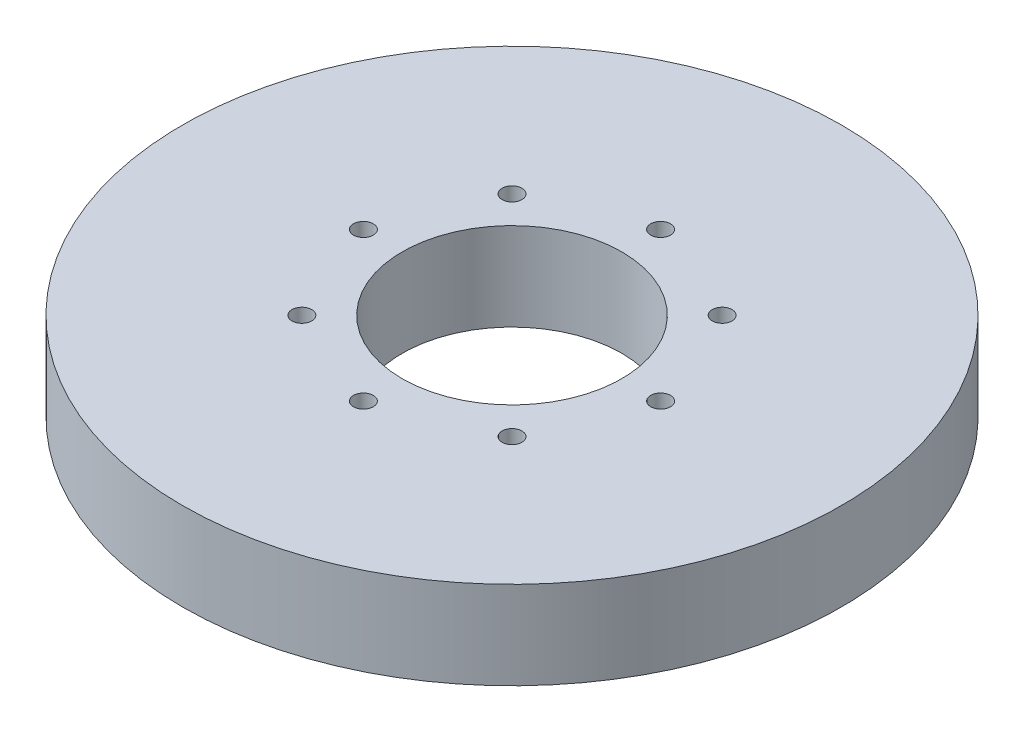
ISO-10303-21;
HEADER;
FILE_DESCRIPTION(('STEP AP214'),'2;1');
FILE_NAME('part.step','',(''),(''),'','','');
FILE_SCHEMA(('AUTOMOTIVE_DESIGN { 1 0 10303 214 1 1 1 1 }'));
ENDSEC;
DATA;
#1=APPLICATION_CONTEXT('core data for automotive mechanical design processes');
#2=APPLICATION_PROTOCOL_DEFINITION('international standard','automotive_design',2000,#1);
#3=PRODUCT_CONTEXT('',#1,'mechanical');
#4=PRODUCT('Part','Part','',(#3));
#5=PRODUCT_RELATED_PRODUCT_CATEGORY('part','',(#4));
#6=PRODUCT_DEFINITION_FORMATION('','',#4);
#7=PRODUCT_DEFINITION_CONTEXT('part definition',#1,'design');
#8=PRODUCT_DEFINITION('design','',#6,#7);
#9=PRODUCT_DEFINITION_SHAPE('','',#8);
#10=(LENGTH_UNIT() NAMED_UNIT(*) SI_UNIT(.MILLI.,.METRE.));
#11=(NAMED_UNIT(*) PLANE_ANGLE_UNIT() SI_UNIT($,.RADIAN.));
#12=(NAMED_UNIT(*) SI_UNIT($,.STERADIAN.) SOLID_ANGLE_UNIT());
#13=UNCERTAINTY_MEASURE_WITH_UNIT(LENGTH_MEASURE(1.E-05),#10,'distance_accuracy_value','');
#14=(GEOMETRIC_REPRESENTATION_CONTEXT(3) GLOBAL_UNCERTAINTY_ASSIGNED_CONTEXT((#13)) GLOBAL_UNIT_ASSIGNED_CONTEXT((#10,
#11,#12)) REPRESENTATION_CONTEXT('',''));
#15=CARTESIAN_POINT('',(0.,0.,0.));
#16=DIRECTION('',(0.,0.,1.));
#17=DIRECTION('',(1.,0.,0.));
#18=AXIS2_PLACEMENT_3D('',#15,#16,#17);
#19=CARTESIAN_POINT('',(0.,22.,0.));
#20=DIRECTION('',(0.,-1.,0.));
#21=DIRECTION('',(0.,0.,-1.));
#22=AXIS2_PLACEMENT_3D('',#19,#20,#21);
#23=CYLINDRICAL_SURFACE('',#22,82.5);
#24=CARTESIAN_POINT('',(0.,22.,0.));
#25=DIRECTION('',(0.,1.,0.));
#26=DIRECTION('',(0.,0.,1.));
#27=AXIS2_PLACEMENT_3D('',#24,#25,#26);
#28=CIRCLE('',#27,82.5);
#29=CARTESIAN_POINT('',(0.,22.,82.5));
#30=VERTEX_POINT('',#29);
#31=EDGE_CURVE('E10',#30,#30,#28,.T.);
#32=ORIENTED_EDGE('',*,*,#31,.F.);
#33=EDGE_LOOP('',(#32));
#34=FACE_BOUND('',#33,.T.);
#35=CARTESIAN_POINT('',(0.,0.,0.));
#36=DIRECTION('',(0.,1.,0.));
#37=DIRECTION('',(0.,0.,1.));
#38=AXIS2_PLACEMENT_3D('',#35,#36,#37);
#39=CIRCLE('',#38,82.5);
#40=CARTESIAN_POINT('',(0.,0.,82.5));
#41=VERTEX_POINT('',#40);
#42=EDGE_CURVE('E37',#41,#41,#39,.T.);
#43=ORIENTED_EDGE('',*,*,#42,.T.);
#44=EDGE_LOOP('',(#43));
#45=FACE_BOUND('',#44,.T.);
#46=ADVANCED_FACE('F40',(#34,#45),#23,.T.);
#47=CARTESIAN_POINT('',(0.,22.,0.));
#48=DIRECTION('',(0.,1.,0.));
#49=DIRECTION('',(0.,0.,1.));
#50=AXIS2_PLACEMENT_3D('',#47,#48,#49);
#51=PLANE('',#50);
#52=CARTESIAN_POINT('',(1.29892891989206E-13,22.,37.2028028745658));
#53=DIRECTION('',(0.,1.,0.));
#54=DIRECTION('',(1.,0.,0.));
#55=AXIS2_PLACEMENT_3D('',#52,#53,#54);
#56=CIRCLE('',#55,2.47386050219401);
#57=CARTESIAN_POINT('',(2.47386050219414,22.,37.2028028745658));
#58=VERTEX_POINT('',#57);
#59=EDGE_CURVE('E88',#58,#58,#56,.T.);
#60=ORIENTED_EDGE('',*,*,#59,.F.);
#61=EDGE_LOOP('',(#60));
#62=FACE_BOUND('',#61,.T.);
#63=CARTESIAN_POINT('',(26.306354191752,22.,26.3063541917517));
#64=DIRECTION('',(0.,1.,0.));
#65=DIRECTION('',(0.707106781186544,0.,-0.707106781186551));
#66=AXIS2_PLACEMENT_3D('',#63,#64,#65);
#67=CIRCLE('',#66,2.47386050219401);
#68=CARTESIAN_POINT('',(28.0556377285629,22.,24.5570706549408));
#69=VERTEX_POINT('',#68);
#70=EDGE_CURVE('E79',#69,#69,#67,.T.);
#71=ORIENTED_EDGE('',*,*,#70,.F.);
#72=EDGE_LOOP('',(#71));
#73=FACE_BOUND('',#72,.T.);
#74=CARTESIAN_POINT('',(37.2028028745658,22.,0.));
#75=DIRECTION('',(0.,1.,0.));
#76=DIRECTION('',(0.,0.,-1.));
#77=AXIS2_PLACEMENT_3D('',#74,#75,#76);
#78=CIRCLE('',#77,2.47386050219401);
#79=CARTESIAN_POINT('',(37.2028028745658,22.,-2.47386050219401));
#80=VERTEX_POINT('',#79);
#81=EDGE_CURVE('E74',#80,#80,#78,.T.);
#82=ORIENTED_EDGE('',*,*,#81,.F.);
#83=EDGE_LOOP('',(#82));
#84=FACE_BOUND('',#83,.T.);
#85=CARTESIAN_POINT('',(26.3063541917516,22.,-26.3063541917521));
#86=DIRECTION('',(0.,1.,0.));
#87=DIRECTION('',(-0.707106781186554,0.,-0.707106781186541));
#88=AXIS2_PLACEMENT_3D('',#85,#86,#87);
#89=CIRCLE('',#88,2.47386050219401);
#90=CARTESIAN_POINT('',(24.5570706549407,22.,-28.055637728563));
#91=VERTEX_POINT('',#90);
#92=EDGE_CURVE('E70',#91,#91,#89,.T.);
#93=ORIENTED_EDGE('',*,*,#92,.F.);
#94=EDGE_LOOP('',(#93));
#95=FACE_BOUND('',#94,.T.);
#96=CARTESIAN_POINT('',(-3.89678675967618E-13,22.,-37.2028028745658));
#97=DIRECTION('',(0.,1.,0.));
#98=DIRECTION('',(-1.,0.,0.));
#99=AXIS2_PLACEMENT_3D('',#96,#97,#98);
#100=CIRCLE('',#99,2.47386050219401);
#101=CARTESIAN_POINT('',(-2.4738605021944,22.,-37.2028028745658));
#102=VERTEX_POINT('',#101);
#103=EDGE_CURVE('E100',#102,#102,#100,.T.);
#104=ORIENTED_EDGE('',*,*,#103,.F.);
#105=EDGE_LOOP('',(#104));
#106=FACE_BOUND('',#105,.T.);
#107=CARTESIAN_POINT('',(-26.3063541917522,22.,-26.3063541917515));
#108=DIRECTION('',(0.,1.,0.));
#109=DIRECTION('',(-0.707106781186539,0.,0.707106781186556));
#110=AXIS2_PLACEMENT_3D('',#107,#108,#109);
#111=CIRCLE('',#110,2.47386050219401);
#112=CARTESIAN_POINT('',(-28.0556377285631,22.,-24.5570706549406));
#113=VERTEX_POINT('',#112);
#114=EDGE_CURVE('E93',#113,#113,#111,.T.);
#115=ORIENTED_EDGE('',*,*,#114,.F.);
#116=EDGE_LOOP('',(#115));
#117=FACE_BOUND('',#116,.T.);
#118=CARTESIAN_POINT('',(-26.3063541917518,22.,26.3063541917519));
#119=DIRECTION('',(0.,1.,0.));
#120=DIRECTION('',(0.707106781186549,0.,0.707106781186546));
#121=AXIS2_PLACEMENT_3D('',#118,#119,#120);
#122=CIRCLE('',#121,2.47386050219401);
#123=CARTESIAN_POINT('',(-24.5570706549409,22.,28.0556377285628));
#124=VERTEX_POINT('',#123);
#125=EDGE_CURVE('E61',#124,#124,#122,.T.);
#126=ORIENTED_EDGE('',*,*,#125,.F.);
#127=EDGE_LOOP('',(#126));
#128=FACE_BOUND('',#127,.T.);
#129=CARTESIAN_POINT('',(-37.2028028745658,22.,0.));
#130=DIRECTION('',(0.,1.,0.));
#131=DIRECTION('',(0.,0.,1.));
#132=AXIS2_PLACEMENT_3D('',#129,#130,#131);
#133=CIRCLE('',#132,2.47386050219401);
#134=CARTESIAN_POINT('',(-37.2028028745658,22.,2.47386050219401));
#135=VERTEX_POINT('',#134);
#136=EDGE_CURVE('E54',#135,#135,#133,.T.);
#137=ORIENTED_EDGE('',*,*,#136,.F.);
#138=EDGE_LOOP('',(#137));
#139=FACE_BOUND('',#138,.T.);
#140=CARTESIAN_POINT('',(0.,22.,0.));
#141=DIRECTION('',(0.,1.,0.));
#142=DIRECTION('',(0.,0.,1.));
#143=AXIS2_PLACEMENT_3D('',#140,#141,#142);
#144=CIRCLE('',#143,27.5);
#145=CARTESIAN_POINT('',(0.,22.,27.5));
#146=VERTEX_POINT('',#145);
#147=EDGE_CURVE('E50',#146,#146,#144,.T.);
#148=ORIENTED_EDGE('',*,*,#147,.F.);
#149=EDGE_LOOP('',(#148));
#150=FACE_BOUND('',#149,.T.);
#151=ORIENTED_EDGE('',*,*,#31,.T.);
#152=EDGE_LOOP('',(#151));
#153=FACE_BOUND('',#152,.T.);
#154=ADVANCED_FACE('F115',(#62,#73,#84,#95,#106,#117,#128,#139,#150,#153),#51,.T.);
#155=CARTESIAN_POINT('',(0.,0.,0.));
#156=DIRECTION('',(0.,1.,0.));
#157=DIRECTION('',(0.,0.,1.));
#158=AXIS2_PLACEMENT_3D('',#155,#156,#157);
#159=PLANE('',#158);
#160=CARTESIAN_POINT('',(0.,0.,0.));
#161=DIRECTION('',(0.,1.,0.));
#162=DIRECTION('',(0.,0.,1.));
#163=AXIS2_PLACEMENT_3D('',#160,#161,#162);
#164=CIRCLE('',#163,27.5);
#165=CARTESIAN_POINT('',(0.,0.,27.5));
#166=VERTEX_POINT('',#165);
#167=EDGE_CURVE('E47',#166,#166,#164,.T.);
#168=ORIENTED_EDGE('',*,*,#167,.T.);
#169=EDGE_LOOP('',(#168));
#170=FACE_BOUND('',#169,.T.);
#171=ORIENTED_EDGE('',*,*,#42,.F.);
#172=EDGE_LOOP('',(#171));
#173=FACE_BOUND('',#172,.T.);
#174=ADVANCED_FACE('F113',(#170,#173),#159,.F.);
#175=CARTESIAN_POINT('',(0.,22.,0.));
#176=DIRECTION('',(0.,-1.,0.));
#177=DIRECTION('',(0.,0.,-1.));
#178=AXIS2_PLACEMENT_3D('',#175,#176,#177);
#179=CYLINDRICAL_SURFACE('',#178,27.5);
#180=ORIENTED_EDGE('',*,*,#147,.T.);
#181=EDGE_LOOP('',(#180));
#182=FACE_BOUND('',#181,.T.);
#183=ORIENTED_EDGE('',*,*,#167,.F.);
#184=EDGE_LOOP('',(#183));
#185=FACE_BOUND('',#184,.T.);
#186=ADVANCED_FACE('F127',(#182,#185),#179,.F.);
#187=CARTESIAN_POINT('',(-37.2028028745658,3.29584364516429,0.));
#188=DIRECTION('',(0.,1.,0.));
#189=DIRECTION('',(0.,0.,1.));
#190=AXIS2_PLACEMENT_3D('',#187,#188,#189);
#191=CYLINDRICAL_SURFACE('',#190,2.47386050219401);
#192=CARTESIAN_POINT('',(-37.2028028745658,3.29584364516429,0.));
#193=DIRECTION('',(0.,1.,0.));
#194=DIRECTION('',(0.,0.,1.));
#195=AXIS2_PLACEMENT_3D('',#192,#193,#194);
#196=CIRCLE('',#195,2.47386050219401);
#197=CARTESIAN_POINT('',(-37.2028028745658,3.29584364516429,2.47386050219401));
#198=VERTEX_POINT('',#197);
#199=EDGE_CURVE('E55',#198,#198,#196,.T.);
#200=ORIENTED_EDGE('',*,*,#199,.F.);
#201=EDGE_LOOP('',(#200));
#202=FACE_BOUND('',#201,.T.);
#203=ORIENTED_EDGE('',*,*,#136,.T.);
#204=EDGE_LOOP('',(#203));
#205=FACE_BOUND('',#204,.T.);
#206=ADVANCED_FACE('F129',(#202,#205),#191,.F.);
#207=CARTESIAN_POINT('',(-37.2028028745658,3.29584364516429,0.));
#208=DIRECTION('',(0.,1.,0.));
#209=DIRECTION('',(0.,0.,1.));
#210=AXIS2_PLACEMENT_3D('',#207,#208,#209);
#211=PLANE('',#210);
#212=ORIENTED_EDGE('',*,*,#199,.T.);
#213=EDGE_LOOP('',(#212));
#214=FACE_BOUND('',#213,.T.);
#215=ADVANCED_FACE('F157',(#214),#211,.T.);
#216=CARTESIAN_POINT('',(-26.3063541917518,3.29584364516429,26.3063541917519));
#217=DIRECTION('',(0.,1.,0.));
#218=DIRECTION('',(0.,0.,1.));
#219=AXIS2_PLACEMENT_3D('',#216,#217,#218);
#220=CYLINDRICAL_SURFACE('',#219,2.47386050219401);
#221=CARTESIAN_POINT('',(-26.3063541917518,3.29584364516429,26.3063541917519));
#222=DIRECTION('',(0.,1.,0.));
#223=DIRECTION('',(0.707106781186549,0.,0.707106781186546));
#224=AXIS2_PLACEMENT_3D('',#221,#222,#223);
#225=CIRCLE('',#224,2.47386050219401);
#226=CARTESIAN_POINT('',(-24.5570706549409,3.29584364516429,28.0556377285628));
#227=VERTEX_POINT('',#226);
#228=EDGE_CURVE('E59',#227,#227,#225,.T.);
#229=ORIENTED_EDGE('',*,*,#228,.F.);
#230=EDGE_LOOP('',(#229));
#231=FACE_BOUND('',#230,.T.);
#232=ORIENTED_EDGE('',*,*,#125,.T.);
#233=EDGE_LOOP('',(#232));
#234=FACE_BOUND('',#233,.T.);
#235=ADVANCED_FACE('F170',(#231,#234),#220,.F.);
#236=CARTESIAN_POINT('',(-26.3063541917518,3.29584364516429,26.3063541917519));
#237=DIRECTION('',(0.,1.,0.));
#238=DIRECTION('',(0.707106781186549,0.,0.707106781186546));
#239=AXIS2_PLACEMENT_3D('',#236,#237,#238);
#240=PLANE('',#239);
#241=ORIENTED_EDGE('',*,*,#228,.T.);
#242=EDGE_LOOP('',(#241));
#243=FACE_BOUND('',#242,.T.);
#244=ADVANCED_FACE('F182',(#243),#240,.T.);
#245=CARTESIAN_POINT('',(-26.3063541917522,3.29584364516429,-26.3063541917515));
#246=DIRECTION('',(0.,1.,0.));
#247=DIRECTION('',(0.,0.,1.));
#248=AXIS2_PLACEMENT_3D('',#245,#246,#247);
#249=CYLINDRICAL_SURFACE('',#248,2.47386050219401);
#250=CARTESIAN_POINT('',(-26.3063541917522,3.29584364516429,-26.3063541917515));
#251=DIRECTION('',(0.,1.,0.));
#252=DIRECTION('',(-0.707106781186539,0.,0.707106781186556));
#253=AXIS2_PLACEMENT_3D('',#250,#251,#252);
#254=CIRCLE('',#253,2.47386050219401);
#255=CARTESIAN_POINT('',(-28.0556377285631,3.29584364516429,-24.5570706549406));
#256=VERTEX_POINT('',#255);
#257=EDGE_CURVE('E94',#256,#256,#254,.T.);
#258=ORIENTED_EDGE('',*,*,#257,.F.);
#259=EDGE_LOOP('',(#258));
#260=FACE_BOUND('',#259,.T.);
#261=ORIENTED_EDGE('',*,*,#114,.T.);
#262=EDGE_LOOP('',(#261));
#263=FACE_BOUND('',#262,.T.);
#264=ADVANCED_FACE('F189',(#260,#263),#249,.F.);
#265=CARTESIAN_POINT('',(-26.3063541917522,3.29584364516429,-26.3063541917515));
#266=DIRECTION('',(0.,1.,0.));
#267=DIRECTION('',(-0.707106781186539,0.,0.707106781186556));
#268=AXIS2_PLACEMENT_3D('',#265,#266,#267);
#269=PLANE('',#268);
#270=ORIENTED_EDGE('',*,*,#257,.T.);
#271=EDGE_LOOP('',(#270));
#272=FACE_BOUND('',#271,.T.);
#273=ADVANCED_FACE('F107',(#272),#269,.T.);
#274=CARTESIAN_POINT('',(-3.89678675967618E-13,3.29584364516429,-37.2028028745658));
#275=DIRECTION('',(0.,1.,0.));
#276=DIRECTION('',(0.,0.,1.));
#277=AXIS2_PLACEMENT_3D('',#274,#275,#276);
#278=CYLINDRICAL_SURFACE('',#277,2.47386050219401);
#279=CARTESIAN_POINT('',(-3.89678675967618E-13,3.29584364516429,-37.2028028745658));
#280=DIRECTION('',(0.,1.,0.));
#281=DIRECTION('',(-1.,0.,0.));
#282=AXIS2_PLACEMENT_3D('',#279,#280,#281);
#283=CIRCLE('',#282,2.47386050219401);
#284=CARTESIAN_POINT('',(-2.4738605021944,3.29584364516429,-37.2028028745658));
#285=VERTEX_POINT('',#284);
#286=EDGE_CURVE('E72',#285,#285,#283,.T.);
#287=ORIENTED_EDGE('',*,*,#286,.F.);
#288=EDGE_LOOP('',(#287));
#289=FACE_BOUND('',#288,.T.);
#290=ORIENTED_EDGE('',*,*,#103,.T.);
#291=EDGE_LOOP('',(#290));
#292=FACE_BOUND('',#291,.T.);
#293=ADVANCED_FACE('F104',(#289,#292),#278,.F.);
#294=CARTESIAN_POINT('',(-3.89678675967618E-13,3.29584364516429,-37.2028028745658));
#295=DIRECTION('',(0.,1.,0.));
#296=DIRECTION('',(-1.,0.,0.));
#297=AXIS2_PLACEMENT_3D('',#294,#295,#296);
#298=PLANE('',#297);
#299=ORIENTED_EDGE('',*,*,#286,.T.);
#300=EDGE_LOOP('',(#299));
#301=FACE_BOUND('',#300,.T.);
#302=ADVANCED_FACE('F103',(#301),#298,.T.);
#303=CARTESIAN_POINT('',(26.3063541917516,3.29584364516429,-26.3063541917521));
#304=DIRECTION('',(0.,1.,0.));
#305=DIRECTION('',(0.,0.,1.));
#306=AXIS2_PLACEMENT_3D('',#303,#304,#305);
#307=CYLINDRICAL_SURFACE('',#306,2.47386050219401);
#308=CARTESIAN_POINT('',(26.3063541917516,3.29584364516429,-26.3063541917521));
#309=DIRECTION('',(0.,1.,0.));
#310=DIRECTION('',(-0.707106781186554,0.,-0.707106781186541));
#311=AXIS2_PLACEMENT_3D('',#308,#309,#310);
#312=CIRCLE('',#311,2.47386050219401);
#313=CARTESIAN_POINT('',(24.5570706549407,3.29584364516429,-28.055637728563));
#314=VERTEX_POINT('',#313);
#315=EDGE_CURVE('E69',#314,#314,#312,.T.);
#316=ORIENTED_EDGE('',*,*,#315,.F.);
#317=EDGE_LOOP('',(#316));
#318=FACE_BOUND('',#317,.T.);
#319=ORIENTED_EDGE('',*,*,#92,.T.);
#320=EDGE_LOOP('',(#319));
#321=FACE_BOUND('',#320,.T.);
#322=ADVANCED_FACE('F219',(#318,#321),#307,.F.);
#323=CARTESIAN_POINT('',(26.3063541917516,3.29584364516429,-26.3063541917521));
#324=DIRECTION('',(0.,1.,0.));
#325=DIRECTION('',(-0.707106781186554,0.,-0.707106781186541));
#326=AXIS2_PLACEMENT_3D('',#323,#324,#325);
#327=PLANE('',#326);
#328=ORIENTED_EDGE('',*,*,#315,.T.);
#329=EDGE_LOOP('',(#328));
#330=FACE_BOUND('',#329,.T.);
#331=ADVANCED_FACE('F227',(#330),#327,.T.);
#332=CARTESIAN_POINT('',(37.2028028745658,3.29584364516429,0.));
#333=DIRECTION('',(0.,1.,0.));
#334=DIRECTION('',(0.,0.,1.));
#335=AXIS2_PLACEMENT_3D('',#332,#333,#334);
#336=CYLINDRICAL_SURFACE('',#335,2.47386050219401);
#337=CARTESIAN_POINT('',(37.2028028745658,3.29584364516429,0.));
#338=DIRECTION('',(0.,1.,0.));
#339=DIRECTION('',(0.,0.,-1.));
#340=AXIS2_PLACEMENT_3D('',#337,#338,#339);
#341=CIRCLE('',#340,2.47386050219401);
#342=CARTESIAN_POINT('',(37.2028028745658,3.29584364516429,-2.47386050219401));
#343=VERTEX_POINT('',#342);
#344=EDGE_CURVE('E80',#343,#343,#341,.T.);
#345=ORIENTED_EDGE('',*,*,#344,.F.);
#346=EDGE_LOOP('',(#345));
#347=FACE_BOUND('',#346,.T.);
#348=ORIENTED_EDGE('',*,*,#81,.T.);
#349=EDGE_LOOP('',(#348));
#350=FACE_BOUND('',#349,.T.);
#351=ADVANCED_FACE('F240',(#347,#350),#336,.F.);
#352=CARTESIAN_POINT('',(37.2028028745658,3.29584364516429,0.));
#353=DIRECTION('',(0.,1.,0.));
#354=DIRECTION('',(0.,0.,-1.));
#355=AXIS2_PLACEMENT_3D('',#352,#353,#354);
#356=PLANE('',#355);
#357=ORIENTED_EDGE('',*,*,#344,.T.);
#358=EDGE_LOOP('',(#357));
#359=FACE_BOUND('',#358,.T.);
#360=ADVANCED_FACE('F246',(#359),#356,.T.);
#361=CARTESIAN_POINT('',(26.306354191752,3.29584364516429,26.3063541917517));
#362=DIRECTION('',(0.,1.,0.));
#363=DIRECTION('',(0.,0.,1.));
#364=AXIS2_PLACEMENT_3D('',#361,#362,#363);
#365=CYLINDRICAL_SURFACE('',#364,2.47386050219401);
#366=CARTESIAN_POINT('',(26.306354191752,3.29584364516429,26.3063541917517));
#367=DIRECTION('',(0.,1.,0.));
#368=DIRECTION('',(0.707106781186544,0.,-0.707106781186551));
#369=AXIS2_PLACEMENT_3D('',#366,#367,#368);
#370=CIRCLE('',#369,2.47386050219401);
#371=CARTESIAN_POINT('',(28.0556377285629,3.29584364516429,24.5570706549408));
#372=VERTEX_POINT('',#371);
#373=EDGE_CURVE('E82',#372,#372,#370,.T.);
#374=ORIENTED_EDGE('',*,*,#373,.F.);
#375=EDGE_LOOP('',(#374));
#376=FACE_BOUND('',#375,.T.);
#377=ORIENTED_EDGE('',*,*,#70,.T.);
#378=EDGE_LOOP('',(#377));
#379=FACE_BOUND('',#378,.T.);
#380=ADVANCED_FACE('F254',(#376,#379),#365,.F.);
#381=CARTESIAN_POINT('',(26.306354191752,3.29584364516429,26.3063541917517));
#382=DIRECTION('',(0.,1.,0.));
#383=DIRECTION('',(0.707106781186544,0.,-0.707106781186551));
#384=AXIS2_PLACEMENT_3D('',#381,#382,#383);
#385=PLANE('',#384);
#386=ORIENTED_EDGE('',*,*,#373,.T.);
#387=EDGE_LOOP('',(#386));
#388=FACE_BOUND('',#387,.T.);
#389=ADVANCED_FACE('F262',(#388),#385,.T.);
#390=CARTESIAN_POINT('',(1.29892891989206E-13,3.29584364516429,37.2028028745658));
#391=DIRECTION('',(0.,1.,0.));
#392=DIRECTION('',(0.,0.,1.));
#393=AXIS2_PLACEMENT_3D('',#390,#391,#392);
#394=CYLINDRICAL_SURFACE('',#393,2.47386050219401);
#395=CARTESIAN_POINT('',(1.29892891989206E-13,3.29584364516429,37.2028028745658));
#396=DIRECTION('',(0.,1.,0.));
#397=DIRECTION('',(1.,0.,0.));
#398=AXIS2_PLACEMENT_3D('',#395,#396,#397);
#399=CIRCLE('',#398,2.47386050219401);
#400=CARTESIAN_POINT('',(2.47386050219414,3.29584364516429,37.2028028745658));
#401=VERTEX_POINT('',#400);
#402=EDGE_CURVE('E63',#401,#401,#399,.T.);
#403=ORIENTED_EDGE('',*,*,#402,.F.);
#404=EDGE_LOOP('',(#403));
#405=FACE_BOUND('',#404,.T.);
#406=ORIENTED_EDGE('',*,*,#59,.T.);
#407=EDGE_LOOP('',(#406));
#408=FACE_BOUND('',#407,.T.);
#409=ADVANCED_FACE('F272',(#405,#408),#394,.F.);
#410=CARTESIAN_POINT('',(1.29892891989206E-13,3.29584364516429,37.2028028745658));
#411=DIRECTION('',(0.,1.,0.));
#412=DIRECTION('',(1.,0.,0.));
#413=AXIS2_PLACEMENT_3D('',#410,#411,#412);
#414=PLANE('',#413);
#415=ORIENTED_EDGE('',*,*,#402,.T.);
#416=EDGE_LOOP('',(#415));
#417=FACE_BOUND('',#416,.T.);
#418=ADVANCED_FACE('F285',(#417),#414,.T.);
#419=CLOSED_SHELL('',(#46,#154,#174,#186,#206,#215,#235,#244,#264,#273,#293,#302,#322,#331,#351,
#360,#380,#389,#409,#418));
#420=MANIFOLD_SOLID_BREP('B2',#419);
#421=ADVANCED_BREP_SHAPE_REPRESENTATION('',(#18,#420),#14);
#422=SHAPE_DEFINITION_REPRESENTATION(#9,#421);
ENDSEC;
END-ISO-10303-21;
